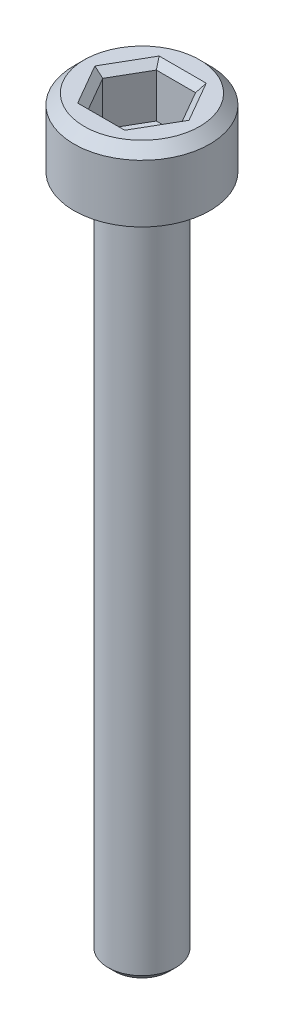
ISO-10303-21;
HEADER;
FILE_DESCRIPTION(('STEP AP214'),'2;1');
FILE_NAME('part.step','',(''),(''),'','','');
FILE_SCHEMA(('AUTOMOTIVE_DESIGN { 1 0 10303 214 1 1 1 1 }'));
ENDSEC;
DATA;
#1=APPLICATION_CONTEXT('core data for automotive mechanical design processes');
#2=APPLICATION_PROTOCOL_DEFINITION('international standard','automotive_design',2000,#1);
#3=PRODUCT_CONTEXT('',#1,'mechanical');
#4=PRODUCT('Part','Part','',(#3));
#5=PRODUCT_RELATED_PRODUCT_CATEGORY('part','',(#4));
#6=PRODUCT_DEFINITION_FORMATION('','',#4);
#7=PRODUCT_DEFINITION_CONTEXT('part definition',#1,'design');
#8=PRODUCT_DEFINITION('design','',#6,#7);
#9=PRODUCT_DEFINITION_SHAPE('','',#8);
#10=(LENGTH_UNIT() NAMED_UNIT(*) SI_UNIT(.MILLI.,.METRE.));
#11=(NAMED_UNIT(*) PLANE_ANGLE_UNIT() SI_UNIT($,.RADIAN.));
#12=(NAMED_UNIT(*) SI_UNIT($,.STERADIAN.) SOLID_ANGLE_UNIT());
#13=UNCERTAINTY_MEASURE_WITH_UNIT(LENGTH_MEASURE(1.E-05),#10,'distance_accuracy_value','');
#14=(GEOMETRIC_REPRESENTATION_CONTEXT(3) GLOBAL_UNCERTAINTY_ASSIGNED_CONTEXT((#13)) GLOBAL_UNIT_ASSIGNED_CONTEXT((#10,
#11,#12)) REPRESENTATION_CONTEXT('',''));
#15=CARTESIAN_POINT('',(0.,0.,0.));
#16=DIRECTION('',(0.,0.,1.));
#17=DIRECTION('',(1.,0.,0.));
#18=AXIS2_PLACEMENT_3D('',#15,#16,#17);
#19=CARTESIAN_POINT('',(0.,0.,0.));
#20=DIRECTION('',(0.,1.,0.));
#21=DIRECTION('',(0.,0.,1.));
#22=AXIS2_PLACEMENT_3D('',#19,#20,#21);
#23=PLANE('',#22);
#24=CARTESIAN_POINT('',(0.,0.,0.));
#25=DIRECTION('',(0.,1.,0.));
#26=DIRECTION('',(0.,0.,1.));
#27=AXIS2_PLACEMENT_3D('',#24,#25,#26);
#28=CIRCLE('',#27,2.);
#29=CARTESIAN_POINT('',(0.,0.,2.));
#30=VERTEX_POINT('',#29);
#31=EDGE_CURVE('E146',#30,#30,#28,.T.);
#32=ORIENTED_EDGE('',*,*,#31,.F.);
#33=EDGE_LOOP('',(#32));
#34=FACE_BOUND('',#33,.T.);
#35=CARTESIAN_POINT('',(0.,0.,0.));
#36=DIRECTION('',(0.,1.,0.));
#37=DIRECTION('',(0.,0.,1.));
#38=AXIS2_PLACEMENT_3D('',#35,#36,#37);
#39=CIRCLE('',#38,1.);
#40=CARTESIAN_POINT('',(0.,0.,1.));
#41=VERTEX_POINT('',#40);
#42=EDGE_CURVE('E185',#41,#41,#39,.F.);
#43=ORIENTED_EDGE('',*,*,#42,.F.);
#44=EDGE_LOOP('',(#43));
#45=FACE_BOUND('',#44,.T.);
#46=ADVANCED_FACE('F33',(#34,#45),#23,.F.);
#47=CARTESIAN_POINT('',(0.,2.,0.));
#48=DIRECTION('',(0.,-1.,0.));
#49=DIRECTION('',(0.,0.,-1.));
#50=AXIS2_PLACEMENT_3D('',#47,#48,#49);
#51=CYLINDRICAL_SURFACE('',#50,2.);
#52=CARTESIAN_POINT('',(0.,1.7,0.));
#53=DIRECTION('',(0.,1.,0.));
#54=DIRECTION('',(0.,0.,1.));
#55=AXIS2_PLACEMENT_3D('',#52,#53,#54);
#56=CIRCLE('',#55,2.);
#57=CARTESIAN_POINT('',(0.,1.7,2.));
#58=VERTEX_POINT('',#57);
#59=EDGE_CURVE('E160',#58,#58,#56,.F.);
#60=ORIENTED_EDGE('',*,*,#59,.T.);
#61=EDGE_LOOP('',(#60));
#62=FACE_BOUND('',#61,.T.);
#63=ORIENTED_EDGE('',*,*,#31,.T.);
#64=EDGE_LOOP('',(#63));
#65=FACE_BOUND('',#64,.T.);
#66=ADVANCED_FACE('F213',(#62,#65),#51,.T.);
#67=CARTESIAN_POINT('',(0.,2.,0.));
#68=DIRECTION('',(0.,1.,0.));
#69=DIRECTION('',(0.,0.,1.));
#70=AXIS2_PLACEMENT_3D('',#67,#68,#69);
#71=PLANE('',#70);
#72=DIRECTION('',(1.,0.,0.));
#73=VECTOR('',#72,1.);
#74=CARTESIAN_POINT('',(0.577350269189625,2.,-1.2));
#75=LINE('',#74,#73);
#76=CARTESIAN_POINT('',(-0.692820323027552,2.,-1.2));
#77=VERTEX_POINT('',#76);
#78=CARTESIAN_POINT('',(0.692820323027551,2.,-1.2));
#79=VERTEX_POINT('',#78);
#80=EDGE_CURVE('E165',#77,#79,#75,.T.);
#81=ORIENTED_EDGE('',*,*,#80,.T.);
#82=DIRECTION('',(0.5,0.,0.866025403784438));
#83=VECTOR('',#82,1.);
#84=CARTESIAN_POINT('',(1.32790561913614,2.,-0.100000000000001));
#85=LINE('',#84,#83);
#86=CARTESIAN_POINT('',(1.3856406460551,2.,0.));
#87=VERTEX_POINT('',#86);
#88=EDGE_CURVE('E175',#79,#87,#85,.T.);
#89=ORIENTED_EDGE('',*,*,#88,.T.);
#90=DIRECTION('',(-0.5,0.,0.866025403784439));
#91=VECTOR('',#90,1.);
#92=CARTESIAN_POINT('',(0.750555349946515,2.,1.1));
#93=LINE('',#92,#91);
#94=CARTESIAN_POINT('',(0.692820323027551,2.,1.2));
#95=VERTEX_POINT('',#94);
#96=EDGE_CURVE('E173',#87,#95,#93,.T.);
#97=ORIENTED_EDGE('',*,*,#96,.T.);
#98=DIRECTION('',(-1.,0.,0.));
#99=VECTOR('',#98,1.);
#100=CARTESIAN_POINT('',(-0.577350269189626,2.,1.2));
#101=LINE('',#100,#99);
#102=CARTESIAN_POINT('',(-0.692820323027551,2.,1.2));
#103=VERTEX_POINT('',#102);
#104=EDGE_CURVE('E171',#95,#103,#101,.T.);
#105=ORIENTED_EDGE('',*,*,#104,.T.);
#106=DIRECTION('',(-0.5,0.,-0.866025403784439));
#107=VECTOR('',#106,1.);
#108=CARTESIAN_POINT('',(-1.32790561913614,2.,0.100000000000001));
#109=LINE('',#108,#107);
#110=CARTESIAN_POINT('',(-1.3856406460551,2.,0.));
#111=VERTEX_POINT('',#110);
#112=EDGE_CURVE('E169',#103,#111,#109,.T.);
#113=ORIENTED_EDGE('',*,*,#112,.T.);
#114=DIRECTION('',(0.5,0.,-0.866025403784439));
#115=VECTOR('',#114,1.);
#116=CARTESIAN_POINT('',(-0.750555349946515,2.,-1.1));
#117=LINE('',#116,#115);
#118=EDGE_CURVE('E167',#111,#77,#117,.T.);
#119=ORIENTED_EDGE('',*,*,#118,.T.);
#120=EDGE_LOOP('',(#81,#89,#97,#105,#113,#119));
#121=FACE_BOUND('',#120,.T.);
#122=CARTESIAN_POINT('',(0.,2.,0.));
#123=DIRECTION('',(0.,1.,0.));
#124=DIRECTION('',(0.,0.,1.));
#125=AXIS2_PLACEMENT_3D('',#122,#123,#124);
#126=CIRCLE('',#125,1.7);
#127=CARTESIAN_POINT('',(0.,2.,1.7));
#128=VERTEX_POINT('',#127);
#129=EDGE_CURVE('E157',#128,#128,#126,.T.);
#130=ORIENTED_EDGE('',*,*,#129,.T.);
#131=EDGE_LOOP('',(#130));
#132=FACE_BOUND('',#131,.T.);
#133=ADVANCED_FACE('F219',(#121,#132),#71,.T.);
#134=CARTESIAN_POINT('',(0.,2.,0.));
#135=DIRECTION('',(0.,-1.,0.));
#136=DIRECTION('',(0.,0.,-1.));
#137=AXIS2_PLACEMENT_3D('',#134,#135,#136);
#138=CONICAL_SURFACE('',#137,1.7,0.785398163397447);
#139=ORIENTED_EDGE('',*,*,#59,.F.);
#140=EDGE_LOOP('',(#139));
#141=FACE_BOUND('',#140,.T.);
#142=ORIENTED_EDGE('',*,*,#129,.F.);
#143=EDGE_LOOP('',(#142));
#144=FACE_BOUND('',#143,.T.);
#145=ADVANCED_FACE('F227',(#141,#144),#138,.T.);
#146=CARTESIAN_POINT('',(0.577350269189626,0.5,1.));
#147=DIRECTION('',(0.866025403784439,0.,0.5));
#148=DIRECTION('',(0.5,0.,-0.866025403784439));
#149=AXIS2_PLACEMENT_3D('',#146,#147,#148);
#150=PLANE('',#149);
#151=DIRECTION('',(0.,1.,0.));
#152=VECTOR('',#151,1.);
#153=CARTESIAN_POINT('',(0.577350269189626,0.5,1.));
#154=LINE('',#153,#152);
#155=CARTESIAN_POINT('',(0.577350269189626,0.5,1.));
#156=VERTEX_POINT('',#155);
#157=CARTESIAN_POINT('',(0.577350269189626,1.8,1.));
#158=VERTEX_POINT('',#157);
#159=EDGE_CURVE('E144',#156,#158,#154,.T.);
#160=ORIENTED_EDGE('',*,*,#159,.T.);
#161=DIRECTION('',(0.5,0.,-0.866025403784439));
#162=VECTOR('',#161,1.);
#163=CARTESIAN_POINT('',(1.15470053837925,1.8,0.));
#164=LINE('',#163,#162);
#165=CARTESIAN_POINT('',(1.15470053837925,1.8,0.));
#166=VERTEX_POINT('',#165);
#167=EDGE_CURVE('E113',#158,#166,#164,.T.);
#168=ORIENTED_EDGE('',*,*,#167,.T.);
#169=DIRECTION('',(0.,1.,0.));
#170=VECTOR('',#169,1.);
#171=CARTESIAN_POINT('',(1.15470053837925,0.5,0.));
#172=LINE('',#171,#170);
#173=CARTESIAN_POINT('',(1.15470053837925,0.5,0.));
#174=VERTEX_POINT('',#173);
#175=EDGE_CURVE('E105',#174,#166,#172,.T.);
#176=ORIENTED_EDGE('',*,*,#175,.F.);
#177=DIRECTION('',(0.5,0.,-0.866025403784439));
#178=VECTOR('',#177,1.);
#179=CARTESIAN_POINT('',(0.577350269189626,0.5,1.));
#180=LINE('',#179,#178);
#181=EDGE_CURVE('E110',#156,#174,#180,.T.);
#182=ORIENTED_EDGE('',*,*,#181,.F.);
#183=EDGE_LOOP('',(#160,#168,#176,#182));
#184=FACE_BOUND('',#183,.T.);
#185=ADVANCED_FACE('F108',(#184),#150,.F.);
#186=CARTESIAN_POINT('',(-0.577350269189626,0.5,1.));
#187=DIRECTION('',(0.,0.,1.));
#188=DIRECTION('',(1.,0.,0.));
#189=AXIS2_PLACEMENT_3D('',#186,#187,#188);
#190=PLANE('',#189);
#191=DIRECTION('',(0.,1.,0.));
#192=VECTOR('',#191,1.);
#193=CARTESIAN_POINT('',(-0.577350269189626,0.5,1.));
#194=LINE('',#193,#192);
#195=CARTESIAN_POINT('',(-0.577350269189626,0.5,1.));
#196=VERTEX_POINT('',#195);
#197=CARTESIAN_POINT('',(-0.577350269189626,1.8,1.));
#198=VERTEX_POINT('',#197);
#199=EDGE_CURVE('E147',#196,#198,#194,.T.);
#200=ORIENTED_EDGE('',*,*,#199,.T.);
#201=DIRECTION('',(1.,0.,0.));
#202=VECTOR('',#201,1.);
#203=CARTESIAN_POINT('',(0.577350269189626,1.8,1.));
#204=LINE('',#203,#202);
#205=EDGE_CURVE('E179',#198,#158,#204,.T.);
#206=ORIENTED_EDGE('',*,*,#205,.T.);
#207=ORIENTED_EDGE('',*,*,#159,.F.);
#208=DIRECTION('',(1.,0.,0.));
#209=VECTOR('',#208,1.);
#210=CARTESIAN_POINT('',(-0.577350269189626,0.5,1.));
#211=LINE('',#210,#209);
#212=EDGE_CURVE('E118',#196,#156,#211,.T.);
#213=ORIENTED_EDGE('',*,*,#212,.F.);
#214=EDGE_LOOP('',(#200,#206,#207,#213));
#215=FACE_BOUND('',#214,.T.);
#216=ADVANCED_FACE('F280',(#215),#190,.F.);
#217=CARTESIAN_POINT('',(-1.15470053837925,0.5,0.));
#218=DIRECTION('',(-0.866025403784438,0.,0.5));
#219=DIRECTION('',(0.5,0.,0.866025403784439));
#220=AXIS2_PLACEMENT_3D('',#217,#218,#219);
#221=PLANE('',#220);
#222=DIRECTION('',(0.,1.,0.));
#223=VECTOR('',#222,1.);
#224=CARTESIAN_POINT('',(-1.15470053837925,0.5,0.));
#225=LINE('',#224,#223);
#226=CARTESIAN_POINT('',(-1.15470053837925,0.5,0.));
#227=VERTEX_POINT('',#226);
#228=CARTESIAN_POINT('',(-1.15470053837925,1.8,0.));
#229=VERTEX_POINT('',#228);
#230=EDGE_CURVE('E150',#227,#229,#225,.T.);
#231=ORIENTED_EDGE('',*,*,#230,.T.);
#232=DIRECTION('',(0.5,0.,0.866025403784439));
#233=VECTOR('',#232,1.);
#234=CARTESIAN_POINT('',(-0.577350269189626,1.8,1.));
#235=LINE('',#234,#233);
#236=EDGE_CURVE('E181',#229,#198,#235,.T.);
#237=ORIENTED_EDGE('',*,*,#236,.T.);
#238=ORIENTED_EDGE('',*,*,#199,.F.);
#239=DIRECTION('',(0.5,0.,0.866025403784439));
#240=VECTOR('',#239,1.);
#241=CARTESIAN_POINT('',(-1.15470053837925,0.5,0.));
#242=LINE('',#241,#240);
#243=EDGE_CURVE('E141',#227,#196,#242,.T.);
#244=ORIENTED_EDGE('',*,*,#243,.F.);
#245=EDGE_LOOP('',(#231,#237,#238,#244));
#246=FACE_BOUND('',#245,.T.);
#247=ADVANCED_FACE('F278',(#246),#221,.F.);
#248=CARTESIAN_POINT('',(-0.577350269189626,0.5,-1.));
#249=DIRECTION('',(-0.866025403784439,0.,-0.5));
#250=DIRECTION('',(-0.5,0.,0.866025403784439));
#251=AXIS2_PLACEMENT_3D('',#248,#249,#250);
#252=PLANE('',#251);
#253=DIRECTION('',(0.,1.,0.));
#254=VECTOR('',#253,1.);
#255=CARTESIAN_POINT('',(-0.577350269189626,0.5,-1.));
#256=LINE('',#255,#254);
#257=CARTESIAN_POINT('',(-0.577350269189626,0.5,-1.));
#258=VERTEX_POINT('',#257);
#259=CARTESIAN_POINT('',(-0.577350269189626,1.8,-1.));
#260=VERTEX_POINT('',#259);
#261=EDGE_CURVE('E152',#258,#260,#256,.T.);
#262=ORIENTED_EDGE('',*,*,#261,.T.);
#263=DIRECTION('',(-0.5,0.,0.866025403784439));
#264=VECTOR('',#263,1.);
#265=CARTESIAN_POINT('',(-1.15470053837925,1.8,0.));
#266=LINE('',#265,#264);
#267=EDGE_CURVE('E55',#260,#229,#266,.T.);
#268=ORIENTED_EDGE('',*,*,#267,.T.);
#269=ORIENTED_EDGE('',*,*,#230,.F.);
#270=DIRECTION('',(-0.5,0.,0.866025403784439));
#271=VECTOR('',#270,1.);
#272=CARTESIAN_POINT('',(-0.577350269189626,0.5,-1.));
#273=LINE('',#272,#271);
#274=EDGE_CURVE('E138',#258,#227,#273,.T.);
#275=ORIENTED_EDGE('',*,*,#274,.F.);
#276=EDGE_LOOP('',(#262,#268,#269,#275));
#277=FACE_BOUND('',#276,.T.);
#278=ADVANCED_FACE('F276',(#277),#252,.F.);
#279=CARTESIAN_POINT('',(0.577350269189625,0.5,-1.));
#280=DIRECTION('',(0.,0.,-1.));
#281=DIRECTION('',(-1.,0.,0.));
#282=AXIS2_PLACEMENT_3D('',#279,#280,#281);
#283=PLANE('',#282);
#284=DIRECTION('',(0.,1.,0.));
#285=VECTOR('',#284,1.);
#286=CARTESIAN_POINT('',(0.577350269189625,0.5,-1.));
#287=LINE('',#286,#285);
#288=CARTESIAN_POINT('',(0.577350269189625,0.5,-1.));
#289=VERTEX_POINT('',#288);
#290=CARTESIAN_POINT('',(0.577350269189625,1.8,-1.));
#291=VERTEX_POINT('',#290);
#292=EDGE_CURVE('E117',#289,#291,#287,.T.);
#293=ORIENTED_EDGE('',*,*,#292,.T.);
#294=DIRECTION('',(-1.,0.,0.));
#295=VECTOR('',#294,1.);
#296=CARTESIAN_POINT('',(-0.577350269189626,1.8,-1.));
#297=LINE('',#296,#295);
#298=EDGE_CURVE('E48',#291,#260,#297,.T.);
#299=ORIENTED_EDGE('',*,*,#298,.T.);
#300=ORIENTED_EDGE('',*,*,#261,.F.);
#301=DIRECTION('',(-1.,0.,0.));
#302=VECTOR('',#301,1.);
#303=CARTESIAN_POINT('',(0.577350269189625,0.5,-1.));
#304=LINE('',#303,#302);
#305=EDGE_CURVE('E126',#289,#258,#304,.T.);
#306=ORIENTED_EDGE('',*,*,#305,.F.);
#307=EDGE_LOOP('',(#293,#299,#300,#306));
#308=FACE_BOUND('',#307,.T.);
#309=ADVANCED_FACE('F273',(#308),#283,.F.);
#310=CARTESIAN_POINT('',(1.15470053837925,0.5,0.));
#311=DIRECTION('',(0.866025403784438,0.,-0.5));
#312=DIRECTION('',(-0.5,0.,-0.866025403784439));
#313=AXIS2_PLACEMENT_3D('',#310,#311,#312);
#314=PLANE('',#313);
#315=ORIENTED_EDGE('',*,*,#175,.T.);
#316=DIRECTION('',(-0.5,0.,-0.866025403784439));
#317=VECTOR('',#316,1.);
#318=CARTESIAN_POINT('',(0.577350269189625,1.8,-1.));
#319=LINE('',#318,#317);
#320=EDGE_CURVE('E163',#166,#291,#319,.T.);
#321=ORIENTED_EDGE('',*,*,#320,.T.);
#322=ORIENTED_EDGE('',*,*,#292,.F.);
#323=DIRECTION('',(-0.5,0.,-0.866025403784438));
#324=VECTOR('',#323,1.);
#325=CARTESIAN_POINT('',(1.15470053837925,0.5,0.));
#326=LINE('',#325,#324);
#327=EDGE_CURVE('E121',#174,#289,#326,.T.);
#328=ORIENTED_EDGE('',*,*,#327,.F.);
#329=EDGE_LOOP('',(#315,#321,#322,#328));
#330=FACE_BOUND('',#329,.T.);
#331=ADVANCED_FACE('F122',(#330),#314,.F.);
#332=CARTESIAN_POINT('',(0.,0.5,0.));
#333=DIRECTION('',(0.,1.,0.));
#334=DIRECTION('',(0.,0.,1.));
#335=AXIS2_PLACEMENT_3D('',#332,#333,#334);
#336=PLANE('',#335);
#337=ORIENTED_EDGE('',*,*,#181,.T.);
#338=ORIENTED_EDGE('',*,*,#327,.T.);
#339=ORIENTED_EDGE('',*,*,#305,.T.);
#340=ORIENTED_EDGE('',*,*,#274,.T.);
#341=ORIENTED_EDGE('',*,*,#243,.T.);
#342=ORIENTED_EDGE('',*,*,#212,.T.);
#343=EDGE_LOOP('',(#337,#338,#339,#340,#341,#342));
#344=FACE_BOUND('',#343,.T.);
#345=ADVANCED_FACE('F128',(#344),#336,.T.);
#346=CARTESIAN_POINT('',(-1.15470053837925,1.8,0.));
#347=DIRECTION('',(0.612372435695792,0.70710678118655,-0.353553390593273));
#348=DIRECTION('',(-0.5,0.,-0.866025403784439));
#349=AXIS2_PLACEMENT_3D('',#346,#347,#348);
#350=PLANE('',#349);
#351=DIRECTION('',(0.755928946018457,-0.654653670707974,0.));
#352=VECTOR('',#351,1.);
#353=CARTESIAN_POINT('',(-1.15470053837925,1.8,0.));
#354=LINE('',#353,#352);
#355=EDGE_CURVE('E134',#111,#229,#354,.T.);
#356=ORIENTED_EDGE('',*,*,#355,.F.);
#357=ORIENTED_EDGE('',*,*,#112,.F.);
#358=DIRECTION('',(0.377964473009227,-0.654653670707974,-0.654653670707981));
#359=VECTOR('',#358,1.);
#360=CARTESIAN_POINT('',(-0.577350269189626,1.8,1.));
#361=LINE('',#360,#359);
#362=EDGE_CURVE('E131',#198,#103,#361,.F.);
#363=ORIENTED_EDGE('',*,*,#362,.F.);
#364=ORIENTED_EDGE('',*,*,#236,.F.);
#365=EDGE_LOOP('',(#356,#357,#363,#364));
#366=FACE_BOUND('',#365,.T.);
#367=ADVANCED_FACE('F249',(#366),#350,.T.);
#368=CARTESIAN_POINT('',(-0.577350269189626,1.8,1.));
#369=DIRECTION('',(0.,0.707106781186551,-0.707106781186544));
#370=DIRECTION('',(-1.,0.,0.));
#371=AXIS2_PLACEMENT_3D('',#368,#369,#370);
#372=PLANE('',#371);
#373=ORIENTED_EDGE('',*,*,#362,.T.);
#374=ORIENTED_EDGE('',*,*,#104,.F.);
#375=DIRECTION('',(-0.377964473009228,-0.654653670707974,-0.654653670707981));
#376=VECTOR('',#375,1.);
#377=CARTESIAN_POINT('',(0.577350269189626,1.8,1.));
#378=LINE('',#377,#376);
#379=EDGE_CURVE('E193',#158,#95,#378,.F.);
#380=ORIENTED_EDGE('',*,*,#379,.F.);
#381=ORIENTED_EDGE('',*,*,#205,.F.);
#382=EDGE_LOOP('',(#373,#374,#380,#381));
#383=FACE_BOUND('',#382,.T.);
#384=ADVANCED_FACE('F246',(#383),#372,.T.);
#385=CARTESIAN_POINT('',(-0.577350269189626,1.8,-1.));
#386=DIRECTION('',(0.612372435695792,0.70710678118655,0.353553390593272));
#387=DIRECTION('',(0.5,0.,-0.866025403784439));
#388=AXIS2_PLACEMENT_3D('',#385,#386,#387);
#389=PLANE('',#388);
#390=ORIENTED_EDGE('',*,*,#355,.T.);
#391=ORIENTED_EDGE('',*,*,#267,.F.);
#392=DIRECTION('',(0.377964473009228,-0.654653670707974,0.65465367070798));
#393=VECTOR('',#392,1.);
#394=CARTESIAN_POINT('',(-0.577350269189626,1.8,-1.));
#395=LINE('',#394,#393);
#396=EDGE_CURVE('E190',#77,#260,#395,.T.);
#397=ORIENTED_EDGE('',*,*,#396,.F.);
#398=ORIENTED_EDGE('',*,*,#118,.F.);
#399=EDGE_LOOP('',(#390,#391,#397,#398));
#400=FACE_BOUND('',#399,.T.);
#401=ADVANCED_FACE('F242',(#400),#389,.T.);
#402=CARTESIAN_POINT('',(0.577350269189626,1.8,1.));
#403=DIRECTION('',(-0.612372435695792,0.70710678118655,-0.353553390593272));
#404=DIRECTION('',(-0.5,0.,0.866025403784439));
#405=AXIS2_PLACEMENT_3D('',#402,#403,#404);
#406=PLANE('',#405);
#407=ORIENTED_EDGE('',*,*,#379,.T.);
#408=ORIENTED_EDGE('',*,*,#96,.F.);
#409=DIRECTION('',(-0.755928946018457,-0.654653670707974,0.));
#410=VECTOR('',#409,1.);
#411=CARTESIAN_POINT('',(1.15470053837925,1.8,0.));
#412=LINE('',#411,#410);
#413=EDGE_CURVE('E188',#166,#87,#412,.F.);
#414=ORIENTED_EDGE('',*,*,#413,.F.);
#415=ORIENTED_EDGE('',*,*,#167,.F.);
#416=EDGE_LOOP('',(#407,#408,#414,#415));
#417=FACE_BOUND('',#416,.T.);
#418=ADVANCED_FACE('F238',(#417),#406,.T.);
#419=CARTESIAN_POINT('',(0.577350269189625,1.8,-1.));
#420=DIRECTION('',(0.,0.707106781186551,0.707106781186544));
#421=DIRECTION('',(1.,0.,0.));
#422=AXIS2_PLACEMENT_3D('',#419,#420,#421);
#423=PLANE('',#422);
#424=ORIENTED_EDGE('',*,*,#396,.T.);
#425=ORIENTED_EDGE('',*,*,#298,.F.);
#426=DIRECTION('',(0.377964473009229,0.654653670707974,-0.65465367070798));
#427=VECTOR('',#426,1.);
#428=CARTESIAN_POINT('',(0.41239304942116,1.51428571428571,-0.714285714285713));
#429=LINE('',#428,#427);
#430=EDGE_CURVE('E186',#79,#291,#429,.F.);
#431=ORIENTED_EDGE('',*,*,#430,.F.);
#432=ORIENTED_EDGE('',*,*,#80,.F.);
#433=EDGE_LOOP('',(#424,#425,#431,#432));
#434=FACE_BOUND('',#433,.T.);
#435=ADVANCED_FACE('F234',(#434),#423,.T.);
#436=CARTESIAN_POINT('',(1.15470053837925,1.8,0.));
#437=DIRECTION('',(-0.612372435695792,0.707106781186551,0.353553390593272));
#438=DIRECTION('',(0.5,0.,0.866025403784439));
#439=AXIS2_PLACEMENT_3D('',#436,#437,#438);
#440=PLANE('',#439);
#441=ORIENTED_EDGE('',*,*,#413,.T.);
#442=ORIENTED_EDGE('',*,*,#88,.F.);
#443=ORIENTED_EDGE('',*,*,#430,.T.);
#444=ORIENTED_EDGE('',*,*,#320,.F.);
#445=EDGE_LOOP('',(#441,#442,#443,#444));
#446=FACE_BOUND('',#445,.T.);
#447=ADVANCED_FACE('F231',(#446),#440,.T.);
#448=CARTESIAN_POINT('',(0.,-20.,0.));
#449=DIRECTION('',(0.,1.,0.));
#450=DIRECTION('',(0.,0.,1.));
#451=AXIS2_PLACEMENT_3D('',#448,#449,#450);
#452=CYLINDRICAL_SURFACE('',#451,1.);
#453=CARTESIAN_POINT('',(0.,-19.8,0.));
#454=DIRECTION('',(0.,-1.,0.));
#455=DIRECTION('',(0.,0.,-1.));
#456=AXIS2_PLACEMENT_3D('',#453,#454,#455);
#457=CIRCLE('',#456,1.);
#458=CARTESIAN_POINT('',(0.,-19.8,-1.));
#459=VERTEX_POINT('',#458);
#460=EDGE_CURVE('E11',#459,#459,#457,.F.);
#461=ORIENTED_EDGE('',*,*,#460,.T.);
#462=EDGE_LOOP('',(#461));
#463=FACE_BOUND('',#462,.T.);
#464=ORIENTED_EDGE('',*,*,#42,.T.);
#465=EDGE_LOOP('',(#464));
#466=FACE_BOUND('',#465,.T.);
#467=ADVANCED_FACE('F209',(#463,#466),#452,.T.);
#468=CARTESIAN_POINT('',(0.,-20.,0.));
#469=DIRECTION('',(0.,-1.,0.));
#470=DIRECTION('',(0.,0.,-1.));
#471=AXIS2_PLACEMENT_3D('',#468,#469,#470);
#472=PLANE('',#471);
#473=CARTESIAN_POINT('',(0.,-20.,0.));
#474=DIRECTION('',(0.,-1.,0.));
#475=DIRECTION('',(0.,0.,-1.));
#476=AXIS2_PLACEMENT_3D('',#473,#474,#475);
#477=CIRCLE('',#476,0.800000000000002);
#478=CARTESIAN_POINT('',(0.,-20.,-0.800000000000002));
#479=VERTEX_POINT('',#478);
#480=EDGE_CURVE('E41',#479,#479,#477,.T.);
#481=ORIENTED_EDGE('',*,*,#480,.T.);
#482=EDGE_LOOP('',(#481));
#483=FACE_BOUND('',#482,.T.);
#484=ADVANCED_FACE('F202',(#483),#472,.T.);
#485=CARTESIAN_POINT('',(0.,-20.,0.));
#486=DIRECTION('',(0.,1.,0.));
#487=DIRECTION('',(0.,0.,1.));
#488=AXIS2_PLACEMENT_3D('',#485,#486,#487);
#489=CONICAL_SURFACE('',#488,0.800000000000002,0.785398163397455);
#490=ORIENTED_EDGE('',*,*,#460,.F.);
#491=EDGE_LOOP('',(#490));
#492=FACE_BOUND('',#491,.T.);
#493=ORIENTED_EDGE('',*,*,#480,.F.);
#494=EDGE_LOOP('',(#493));
#495=FACE_BOUND('',#494,.T.);
#496=ADVANCED_FACE('F35',(#492,#495),#489,.T.);
#497=CLOSED_SHELL('',(#46,#66,#133,#145,#185,#216,#247,#278,#309,#331,#345,#367,#384,#401,#418,
#435,#447,#467,#484,#496));
#498=MANIFOLD_SOLID_BREP('B2',#497);
#499=ADVANCED_BREP_SHAPE_REPRESENTATION('',(#18,#498),#14);
#500=SHAPE_DEFINITION_REPRESENTATION(#9,#499);
ENDSEC;
END-ISO-10303-21;
